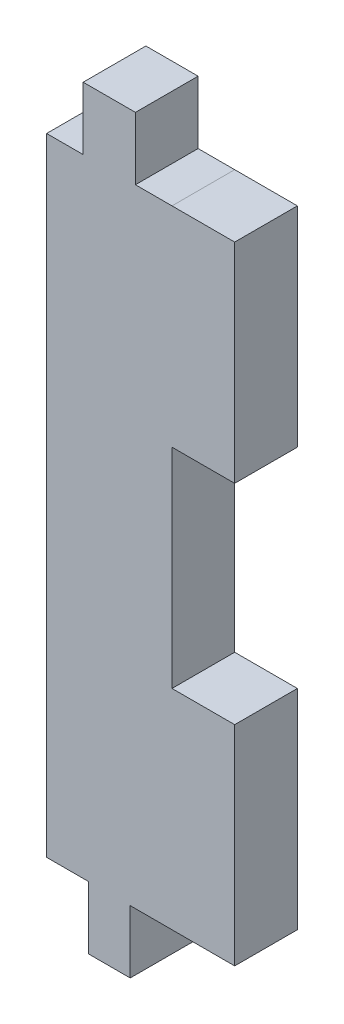
ISO-10303-21;
HEADER;
FILE_DESCRIPTION(('STEP AP214'),'2;1');
FILE_NAME('part.step','',(''),(''),'','','');
FILE_SCHEMA(('AUTOMOTIVE_DESIGN { 1 0 10303 214 1 1 1 1 }'));
ENDSEC;
DATA;
#1=APPLICATION_CONTEXT('core data for automotive mechanical design processes');
#2=APPLICATION_PROTOCOL_DEFINITION('international standard','automotive_design',2000,#1);
#3=PRODUCT_CONTEXT('',#1,'mechanical');
#4=PRODUCT('Part','Part','',(#3));
#5=PRODUCT_RELATED_PRODUCT_CATEGORY('part','',(#4));
#6=PRODUCT_DEFINITION_FORMATION('','',#4);
#7=PRODUCT_DEFINITION_CONTEXT('part definition',#1,'design');
#8=PRODUCT_DEFINITION('design','',#6,#7);
#9=PRODUCT_DEFINITION_SHAPE('','',#8);
#10=(LENGTH_UNIT() NAMED_UNIT(*) SI_UNIT(.MILLI.,.METRE.));
#11=(NAMED_UNIT(*) PLANE_ANGLE_UNIT() SI_UNIT($,.RADIAN.));
#12=(NAMED_UNIT(*) SI_UNIT($,.STERADIAN.) SOLID_ANGLE_UNIT());
#13=UNCERTAINTY_MEASURE_WITH_UNIT(LENGTH_MEASURE(1.E-05),#10,'distance_accuracy_value','');
#14=(GEOMETRIC_REPRESENTATION_CONTEXT(3) GLOBAL_UNCERTAINTY_ASSIGNED_CONTEXT((#13)) GLOBAL_UNIT_ASSIGNED_CONTEXT((#10,
#11,#12)) REPRESENTATION_CONTEXT('',''));
#15=CARTESIAN_POINT('',(0.,0.,0.));
#16=DIRECTION('',(0.,0.,1.));
#17=DIRECTION('',(1.,0.,0.));
#18=AXIS2_PLACEMENT_3D('',#15,#16,#17);
#19=CARTESIAN_POINT('',(-22.2300312184797,-66.1800034107966,5.));
#20=DIRECTION('',(-1.,0.,0.));
#21=DIRECTION('',(0.,0.,1.));
#22=AXIS2_PLACEMENT_3D('',#19,#20,#21);
#23=PLANE('',#22);
#24=DIRECTION('',(0.,0.,-1.));
#25=VECTOR('',#24,1.);
#26=CARTESIAN_POINT('',(-22.2300312184797,-49.5136692647141,5.));
#27=LINE('',#26,#25);
#28=CARTESIAN_POINT('',(-22.2300312184797,-49.5136692647141,5.));
#29=VERTEX_POINT('',#28);
#30=CARTESIAN_POINT('',(-22.2300312184797,-49.5136692647141,0.));
#31=VERTEX_POINT('',#30);
#32=EDGE_CURVE('E111',#29,#31,#27,.T.);
#33=ORIENTED_EDGE('',*,*,#32,.F.);
#34=DIRECTION('',(0.,1.,0.));
#35=VECTOR('',#34,1.);
#36=CARTESIAN_POINT('',(-22.2300312184797,-66.1800034107966,5.));
#37=LINE('',#36,#35);
#38=CARTESIAN_POINT('',(-22.2300312184797,-66.1800034107966,5.));
#39=VERTEX_POINT('',#38);
#40=EDGE_CURVE('E327',#39,#29,#37,.T.);
#41=ORIENTED_EDGE('',*,*,#40,.F.);
#42=DIRECTION('',(0.,0.,-1.));
#43=VECTOR('',#42,1.);
#44=CARTESIAN_POINT('',(-22.2300312184797,-66.1800034107966,5.));
#45=LINE('',#44,#43);
#46=CARTESIAN_POINT('',(-22.2300312184797,-66.1800034107966,0.));
#47=VERTEX_POINT('',#46);
#48=EDGE_CURVE('E238',#39,#47,#45,.T.);
#49=ORIENTED_EDGE('',*,*,#48,.T.);
#50=DIRECTION('',(0.,1.,0.));
#51=VECTOR('',#50,1.);
#52=CARTESIAN_POINT('',(-22.2300312184797,-66.1800034107966,0.));
#53=LINE('',#52,#51);
#54=EDGE_CURVE('E334',#47,#31,#53,.T.);
#55=ORIENTED_EDGE('',*,*,#54,.T.);
#56=EDGE_LOOP('',(#33,#41,#49,#55));
#57=FACE_BOUND('',#56,.T.);
#58=ADVANCED_FACE('F103',(#57),#23,.F.);
#59=CARTESIAN_POINT('',(-37.2300312184796,-66.1800034107966,0.));
#60=DIRECTION('',(0.,0.,1.));
#61=DIRECTION('',(1.,0.,0.));
#62=AXIS2_PLACEMENT_3D('',#59,#60,#61);
#63=PLANE('',#62);
#64=DIRECTION('',(1.,0.,0.));
#65=VECTOR('',#64,1.);
#66=CARTESIAN_POINT('',(-37.2300312184797,-16.1800034107966,0.));
#67=LINE('',#66,#65);
#68=CARTESIAN_POINT('',(-30.1466978851463,-16.1800034107966,0.));
#69=VERTEX_POINT('',#68);
#70=CARTESIAN_POINT('',(-27.2300312184797,-16.1801696710887,0.));
#71=VERTEX_POINT('',#70);
#72=EDGE_CURVE('E255',#69,#71,#67,.T.);
#73=ORIENTED_EDGE('',*,*,#72,.T.);
#74=DIRECTION('',(1.,0.,0.));
#75=VECTOR('',#74,1.);
#76=CARTESIAN_POINT('',(-27.2300312184797,-16.1803359313808,0.));
#77=LINE('',#76,#75);
#78=CARTESIAN_POINT('',(-22.2300312184797,-16.1803359313808,0.));
#79=VERTEX_POINT('',#78);
#80=EDGE_CURVE('E330',#71,#79,#77,.T.);
#81=ORIENTED_EDGE('',*,*,#80,.T.);
#82=CARTESIAN_POINT('',(-22.2300312184797,-32.8470025980475,0.));
#83=VERTEX_POINT('',#82);
#84=EDGE_CURVE('E359',#83,#79,#53,.T.);
#85=ORIENTED_EDGE('',*,*,#84,.F.);
#86=DIRECTION('',(1.,0.,0.));
#87=VECTOR('',#86,1.);
#88=CARTESIAN_POINT('',(-27.2300312184797,-32.8470025980475,0.));
#89=LINE('',#88,#87);
#90=CARTESIAN_POINT('',(-27.2300312184797,-32.8470025980475,0.));
#91=VERTEX_POINT('',#90);
#92=EDGE_CURVE('E357',#91,#83,#89,.T.);
#93=ORIENTED_EDGE('',*,*,#92,.F.);
#94=DIRECTION('',(0.,-1.,0.));
#95=VECTOR('',#94,1.);
#96=CARTESIAN_POINT('',(-27.2300312184797,-66.1800034107966,0.));
#97=LINE('',#96,#95);
#98=CARTESIAN_POINT('',(-27.2300312184797,-49.5136692647141,0.));
#99=VERTEX_POINT('',#98);
#100=EDGE_CURVE('E356',#91,#99,#97,.T.);
#101=ORIENTED_EDGE('',*,*,#100,.T.);
#102=DIRECTION('',(1.,0.,0.));
#103=VECTOR('',#102,1.);
#104=CARTESIAN_POINT('',(-27.2300312184797,-49.5136692647141,0.));
#105=LINE('',#104,#103);
#106=EDGE_CURVE('E344',#99,#31,#105,.T.);
#107=ORIENTED_EDGE('',*,*,#106,.T.);
#108=ORIENTED_EDGE('',*,*,#54,.F.);
#109=DIRECTION('',(1.,0.,0.));
#110=VECTOR('',#109,1.);
#111=CARTESIAN_POINT('',(-37.2300312184796,-66.1800034107966,0.));
#112=LINE('',#111,#110);
#113=CARTESIAN_POINT('',(-30.563364551813,-66.1800034107966,0.));
#114=VERTEX_POINT('',#113);
#115=EDGE_CURVE('E252',#114,#47,#112,.T.);
#116=ORIENTED_EDGE('',*,*,#115,.F.);
#117=DIRECTION('',(0.,-1.,0.));
#118=VECTOR('',#117,1.);
#119=CARTESIAN_POINT('',(-30.563364551813,-61.1800034107967,0.));
#120=LINE('',#119,#118);
#121=CARTESIAN_POINT('',(-30.563364551813,-71.1800034107967,0.));
#122=VERTEX_POINT('',#121);
#123=EDGE_CURVE('E217',#114,#122,#120,.T.);
#124=ORIENTED_EDGE('',*,*,#123,.T.);
#125=DIRECTION('',(1.,0.,0.));
#126=VECTOR('',#125,1.);
#127=CARTESIAN_POINT('',(-33.8966978851463,-71.1800034107967,0.));
#128=LINE('',#127,#126);
#129=CARTESIAN_POINT('',(-33.8966978851463,-71.1800034107967,0.));
#130=VERTEX_POINT('',#129);
#131=EDGE_CURVE('E365',#130,#122,#128,.T.);
#132=ORIENTED_EDGE('',*,*,#131,.F.);
#133=DIRECTION('',(0.,-1.,0.));
#134=VECTOR('',#133,1.);
#135=CARTESIAN_POINT('',(-33.8966978851463,-61.1800034107967,0.));
#136=LINE('',#135,#134);
#137=CARTESIAN_POINT('',(-33.8966978851463,-66.1800034107966,0.));
#138=VERTEX_POINT('',#137);
#139=EDGE_CURVE('E233',#138,#130,#136,.T.);
#140=ORIENTED_EDGE('',*,*,#139,.F.);
#141=CARTESIAN_POINT('',(-37.2300312184796,-66.1800034107966,0.));
#142=VERTEX_POINT('',#141);
#143=EDGE_CURVE('E190',#142,#138,#112,.T.);
#144=ORIENTED_EDGE('',*,*,#143,.F.);
#145=DIRECTION('',(0.,-1.,0.));
#146=VECTOR('',#145,1.);
#147=CARTESIAN_POINT('',(-37.2300312184797,-16.1800034107966,0.));
#148=LINE('',#147,#146);
#149=CARTESIAN_POINT('',(-37.2300312184797,-16.1800034107966,0.));
#150=VERTEX_POINT('',#149);
#151=EDGE_CURVE('E249',#150,#142,#148,.T.);
#152=ORIENTED_EDGE('',*,*,#151,.F.);
#153=CARTESIAN_POINT('',(-34.313364551813,-16.1800034107966,0.));
#154=VERTEX_POINT('',#153);
#155=EDGE_CURVE('E245',#150,#154,#67,.T.);
#156=ORIENTED_EDGE('',*,*,#155,.T.);
#157=DIRECTION('',(0.,-1.,0.));
#158=VECTOR('',#157,1.);
#159=CARTESIAN_POINT('',(-34.313364551813,-11.1800034107966,0.));
#160=LINE('',#159,#158);
#161=CARTESIAN_POINT('',(-34.313364551813,-11.1800034107966,0.));
#162=VERTEX_POINT('',#161);
#163=EDGE_CURVE('E386',#162,#154,#160,.T.);
#164=ORIENTED_EDGE('',*,*,#163,.F.);
#165=DIRECTION('',(1.,0.,0.));
#166=VECTOR('',#165,1.);
#167=CARTESIAN_POINT('',(-34.313364551813,-11.1800034107966,0.));
#168=LINE('',#167,#166);
#169=CARTESIAN_POINT('',(-30.1466978851463,-11.1800034107966,0.));
#170=VERTEX_POINT('',#169);
#171=EDGE_CURVE('E377',#162,#170,#168,.T.);
#172=ORIENTED_EDGE('',*,*,#171,.T.);
#173=DIRECTION('',(0.,-1.,0.));
#174=VECTOR('',#173,1.);
#175=CARTESIAN_POINT('',(-30.1466978851463,-11.1800034107966,0.));
#176=LINE('',#175,#174);
#177=EDGE_CURVE('E390',#170,#69,#176,.T.);
#178=ORIENTED_EDGE('',*,*,#177,.T.);
#179=EDGE_LOOP('',(#73,#81,#85,#93,#101,#107,#108,#116,#124,#132,#140,#144,#152,#156,#164,#172,#178));
#180=FACE_BOUND('',#179,.T.);
#181=ADVANCED_FACE('F279',(#180),#63,.F.);
#182=CARTESIAN_POINT('',(-37.2300312184796,-66.1800034107966,5.));
#183=DIRECTION('',(0.,0.,1.));
#184=DIRECTION('',(1.,0.,0.));
#185=AXIS2_PLACEMENT_3D('',#182,#183,#184);
#186=PLANE('',#185);
#187=DIRECTION('',(-1.,0.,0.));
#188=VECTOR('',#187,1.);
#189=CARTESIAN_POINT('',(-37.2300312184796,-32.8470025980475,5.));
#190=LINE('',#189,#188);
#191=CARTESIAN_POINT('',(-22.2300312184797,-32.8470025980475,5.));
#192=VERTEX_POINT('',#191);
#193=CARTESIAN_POINT('',(-27.2300312184797,-32.8470025980475,5.));
#194=VERTEX_POINT('',#193);
#195=EDGE_CURVE('E572',#192,#194,#190,.T.);
#196=ORIENTED_EDGE('',*,*,#195,.F.);
#197=CARTESIAN_POINT('',(-22.2300312184797,-16.1803359313808,5.));
#198=VERTEX_POINT('',#197);
#199=EDGE_CURVE('E333',#192,#198,#37,.T.);
#200=ORIENTED_EDGE('',*,*,#199,.T.);
#201=DIRECTION('',(1.,0.,0.));
#202=VECTOR('',#201,1.);
#203=CARTESIAN_POINT('',(-27.2300312184797,-16.1803359313808,5.));
#204=LINE('',#203,#202);
#205=CARTESIAN_POINT('',(-27.2300312184797,-16.1801696710887,5.));
#206=VERTEX_POINT('',#205);
#207=EDGE_CURVE('E318',#206,#198,#204,.T.);
#208=ORIENTED_EDGE('',*,*,#207,.F.);
#209=DIRECTION('',(1.,0.,0.));
#210=VECTOR('',#209,1.);
#211=CARTESIAN_POINT('',(-37.2300312184797,-16.1800034107966,5.));
#212=LINE('',#211,#210);
#213=CARTESIAN_POINT('',(-30.1466978851463,-16.1800034107966,5.));
#214=VERTEX_POINT('',#213);
#215=EDGE_CURVE('E243',#214,#206,#212,.T.);
#216=ORIENTED_EDGE('',*,*,#215,.F.);
#217=DIRECTION('',(0.,-1.,0.));
#218=VECTOR('',#217,1.);
#219=CARTESIAN_POINT('',(-30.1466978851463,-11.1800034107966,5.));
#220=LINE('',#219,#218);
#221=CARTESIAN_POINT('',(-30.1466978851463,-11.1800034107966,5.));
#222=VERTEX_POINT('',#221);
#223=EDGE_CURVE('E397',#222,#214,#220,.T.);
#224=ORIENTED_EDGE('',*,*,#223,.F.);
#225=DIRECTION('',(1.,0.,0.));
#226=VECTOR('',#225,1.);
#227=CARTESIAN_POINT('',(-34.313364551813,-11.1800034107966,5.));
#228=LINE('',#227,#226);
#229=CARTESIAN_POINT('',(-34.313364551813,-11.1800034107966,5.));
#230=VERTEX_POINT('',#229);
#231=EDGE_CURVE('E389',#230,#222,#228,.T.);
#232=ORIENTED_EDGE('',*,*,#231,.F.);
#233=DIRECTION('',(0.,-1.,0.));
#234=VECTOR('',#233,1.);
#235=CARTESIAN_POINT('',(-34.313364551813,-11.1800034107966,5.));
#236=LINE('',#235,#234);
#237=CARTESIAN_POINT('',(-34.313364551813,-16.1800034107966,5.));
#238=VERTEX_POINT('',#237);
#239=EDGE_CURVE('E384',#230,#238,#236,.T.);
#240=ORIENTED_EDGE('',*,*,#239,.T.);
#241=CARTESIAN_POINT('',(-37.2300312184797,-16.1800034107966,5.));
#242=VERTEX_POINT('',#241);
#243=EDGE_CURVE('E258',#242,#238,#212,.T.);
#244=ORIENTED_EDGE('',*,*,#243,.F.);
#245=DIRECTION('',(0.,-1.,0.));
#246=VECTOR('',#245,1.);
#247=CARTESIAN_POINT('',(-37.2300312184797,-16.1800034107966,5.));
#248=LINE('',#247,#246);
#249=CARTESIAN_POINT('',(-37.2300312184796,-66.1800034107966,5.));
#250=VERTEX_POINT('',#249);
#251=EDGE_CURVE('E240',#242,#250,#248,.T.);
#252=ORIENTED_EDGE('',*,*,#251,.T.);
#253=DIRECTION('',(1.,0.,0.));
#254=VECTOR('',#253,1.);
#255=CARTESIAN_POINT('',(-37.2300312184796,-66.1800034107966,5.));
#256=LINE('',#255,#254);
#257=CARTESIAN_POINT('',(-33.8966978851463,-66.1800034107966,5.));
#258=VERTEX_POINT('',#257);
#259=EDGE_CURVE('E239',#250,#258,#256,.T.);
#260=ORIENTED_EDGE('',*,*,#259,.T.);
#261=DIRECTION('',(0.,-1.,0.));
#262=VECTOR('',#261,1.);
#263=CARTESIAN_POINT('',(-33.8966978851463,-61.1800034107967,5.));
#264=LINE('',#263,#262);
#265=CARTESIAN_POINT('',(-33.8966978851463,-71.1800034107967,5.));
#266=VERTEX_POINT('',#265);
#267=EDGE_CURVE('E371',#258,#266,#264,.T.);
#268=ORIENTED_EDGE('',*,*,#267,.T.);
#269=DIRECTION('',(1.,0.,0.));
#270=VECTOR('',#269,1.);
#271=CARTESIAN_POINT('',(-33.8966978851463,-71.1800034107967,5.));
#272=LINE('',#271,#270);
#273=CARTESIAN_POINT('',(-30.563364551813,-71.1800034107967,5.));
#274=VERTEX_POINT('',#273);
#275=EDGE_CURVE('E231',#266,#274,#272,.T.);
#276=ORIENTED_EDGE('',*,*,#275,.T.);
#277=DIRECTION('',(0.,-1.,0.));
#278=VECTOR('',#277,1.);
#279=CARTESIAN_POINT('',(-30.563364551813,-61.1800034107967,5.));
#280=LINE('',#279,#278);
#281=CARTESIAN_POINT('',(-30.563364551813,-66.1800034107966,5.));
#282=VERTEX_POINT('',#281);
#283=EDGE_CURVE('E215',#282,#274,#280,.T.);
#284=ORIENTED_EDGE('',*,*,#283,.F.);
#285=EDGE_CURVE('E228',#282,#39,#256,.T.);
#286=ORIENTED_EDGE('',*,*,#285,.T.);
#287=ORIENTED_EDGE('',*,*,#40,.T.);
#288=DIRECTION('',(-1.,0.,0.));
#289=VECTOR('',#288,1.);
#290=CARTESIAN_POINT('',(-37.2300312184796,-49.5136692647141,5.));
#291=LINE('',#290,#289);
#292=CARTESIAN_POINT('',(-27.2300312184797,-49.5136692647141,5.));
#293=VERTEX_POINT('',#292);
#294=EDGE_CURVE('E118',#29,#293,#291,.T.);
#295=ORIENTED_EDGE('',*,*,#294,.T.);
#296=DIRECTION('',(0.,-1.,0.));
#297=VECTOR('',#296,1.);
#298=CARTESIAN_POINT('',(-27.2300312184797,-66.1800034107966,5.));
#299=LINE('',#298,#297);
#300=EDGE_CURVE('E576',#194,#293,#299,.T.);
#301=ORIENTED_EDGE('',*,*,#300,.F.);
#302=EDGE_LOOP('',(#196,#200,#208,#216,#224,#232,#240,#244,#252,#260,#268,#276,#284,#286,#287,
#295,#301));
#303=FACE_BOUND('',#302,.T.);
#304=ADVANCED_FACE('F226',(#303),#186,.T.);
#305=CARTESIAN_POINT('',(-37.2300312184797,-16.1800034107966,5.));
#306=DIRECTION('',(0.,1.,0.));
#307=DIRECTION('',(0.,0.,1.));
#308=AXIS2_PLACEMENT_3D('',#305,#306,#307);
#309=PLANE('',#308);
#310=ORIENTED_EDGE('',*,*,#243,.T.);
#311=DIRECTION('',(0.,0.,-1.));
#312=VECTOR('',#311,1.);
#313=CARTESIAN_POINT('',(-34.313364551813,-16.1800034107966,5.));
#314=LINE('',#313,#312);
#315=EDGE_CURVE('E222',#238,#154,#314,.T.);
#316=ORIENTED_EDGE('',*,*,#315,.T.);
#317=ORIENTED_EDGE('',*,*,#155,.F.);
#318=DIRECTION('',(0.,0.,-1.));
#319=VECTOR('',#318,1.);
#320=CARTESIAN_POINT('',(-37.2300312184797,-16.1800034107966,5.));
#321=LINE('',#320,#319);
#322=EDGE_CURVE('E256',#242,#150,#321,.T.);
#323=ORIENTED_EDGE('',*,*,#322,.F.);
#324=EDGE_LOOP('',(#310,#316,#317,#323));
#325=FACE_BOUND('',#324,.T.);
#326=ADVANCED_FACE('F277',(#325),#309,.T.);
#327=CARTESIAN_POINT('',(-37.2300312184797,-16.1800034107966,5.));
#328=DIRECTION('',(1.,0.,0.));
#329=DIRECTION('',(0.,1.,0.));
#330=AXIS2_PLACEMENT_3D('',#327,#328,#329);
#331=PLANE('',#330);
#332=ORIENTED_EDGE('',*,*,#151,.T.);
#333=DIRECTION('',(0.,0.,-1.));
#334=VECTOR('',#333,1.);
#335=CARTESIAN_POINT('',(-37.2300312184796,-66.1800034107966,5.));
#336=LINE('',#335,#334);
#337=EDGE_CURVE('E259',#250,#142,#336,.T.);
#338=ORIENTED_EDGE('',*,*,#337,.F.);
#339=ORIENTED_EDGE('',*,*,#251,.F.);
#340=ORIENTED_EDGE('',*,*,#322,.T.);
#341=EDGE_LOOP('',(#332,#338,#339,#340));
#342=FACE_BOUND('',#341,.T.);
#343=ADVANCED_FACE('F284',(#342),#331,.F.);
#344=CARTESIAN_POINT('',(-37.2300312184796,-66.1800034107966,5.));
#345=DIRECTION('',(0.,1.,0.));
#346=DIRECTION('',(0.,0.,1.));
#347=AXIS2_PLACEMENT_3D('',#344,#345,#346);
#348=PLANE('',#347);
#349=DIRECTION('',(0.,0.,-1.));
#350=VECTOR('',#349,1.);
#351=CARTESIAN_POINT('',(-33.8966978851463,-66.1800034107966,5.));
#352=LINE('',#351,#350);
#353=EDGE_CURVE('E221',#258,#138,#352,.T.);
#354=ORIENTED_EDGE('',*,*,#353,.F.);
#355=ORIENTED_EDGE('',*,*,#259,.F.);
#356=ORIENTED_EDGE('',*,*,#337,.T.);
#357=ORIENTED_EDGE('',*,*,#143,.T.);
#358=EDGE_LOOP('',(#354,#355,#356,#357));
#359=FACE_BOUND('',#358,.T.);
#360=ADVANCED_FACE('F283',(#359),#348,.F.);
#361=ORIENTED_EDGE('',*,*,#285,.F.);
#362=DIRECTION('',(0.,0.,-1.));
#363=VECTOR('',#362,1.);
#364=CARTESIAN_POINT('',(-30.563364551813,-66.1800034107966,5.));
#365=LINE('',#364,#363);
#366=EDGE_CURVE('E211',#282,#114,#365,.T.);
#367=ORIENTED_EDGE('',*,*,#366,.T.);
#368=ORIENTED_EDGE('',*,*,#115,.T.);
#369=ORIENTED_EDGE('',*,*,#48,.F.);
#370=EDGE_LOOP('',(#361,#367,#368,#369));
#371=FACE_BOUND('',#370,.T.);
#372=ADVANCED_FACE('F236',(#371),#348,.F.);
#373=DIRECTION('',(0.,0.,-1.));
#374=VECTOR('',#373,1.);
#375=CARTESIAN_POINT('',(-30.1466978851463,-16.1800034107966,5.));
#376=LINE('',#375,#374);
#377=EDGE_CURVE('E127',#214,#69,#376,.T.);
#378=ORIENTED_EDGE('',*,*,#377,.F.);
#379=ORIENTED_EDGE('',*,*,#215,.T.);
#380=CARTESIAN_POINT('',(-27.2300312184797,-16.1800034107966,5.));
#381=DIRECTION('',(0.,0.,-1.));
#382=VECTOR('',#381,1.);
#383=LINE('',#380,#382);
#384=EDGE_CURVE('E179',#206,#71,#383,.T.);
#385=ORIENTED_EDGE('',*,*,#384,.T.);
#386=ORIENTED_EDGE('',*,*,#72,.F.);
#387=EDGE_LOOP('',(#378,#379,#385,#386));
#388=FACE_BOUND('',#387,.T.);
#389=ADVANCED_FACE('F266',(#388),#309,.T.);
#390=CARTESIAN_POINT('',(-33.8966978851463,-71.1800034107967,5.));
#391=DIRECTION('',(0.,1.,0.));
#392=DIRECTION('',(0.,0.,1.));
#393=AXIS2_PLACEMENT_3D('',#390,#391,#392);
#394=PLANE('',#393);
#395=ORIENTED_EDGE('',*,*,#131,.T.);
#396=DIRECTION('',(0.,0.,-1.));
#397=VECTOR('',#396,1.);
#398=CARTESIAN_POINT('',(-30.563364551813,-71.1800034107967,5.));
#399=LINE('',#398,#397);
#400=EDGE_CURVE('E378',#274,#122,#399,.T.);
#401=ORIENTED_EDGE('',*,*,#400,.F.);
#402=ORIENTED_EDGE('',*,*,#275,.F.);
#403=DIRECTION('',(0.,0.,-1.));
#404=VECTOR('',#403,1.);
#405=CARTESIAN_POINT('',(-33.8966978851463,-71.1800034107967,5.));
#406=LINE('',#405,#404);
#407=EDGE_CURVE('E375',#266,#130,#406,.T.);
#408=ORIENTED_EDGE('',*,*,#407,.T.);
#409=EDGE_LOOP('',(#395,#401,#402,#408));
#410=FACE_BOUND('',#409,.T.);
#411=ADVANCED_FACE('F276',(#410),#394,.F.);
#412=CARTESIAN_POINT('',(-30.563364551813,-61.1800034107967,5.));
#413=DIRECTION('',(1.,0.,0.));
#414=DIRECTION('',(0.,0.,-1.));
#415=AXIS2_PLACEMENT_3D('',#412,#413,#414);
#416=PLANE('',#415);
#417=ORIENTED_EDGE('',*,*,#366,.F.);
#418=ORIENTED_EDGE('',*,*,#283,.T.);
#419=ORIENTED_EDGE('',*,*,#400,.T.);
#420=ORIENTED_EDGE('',*,*,#123,.F.);
#421=EDGE_LOOP('',(#417,#418,#419,#420));
#422=FACE_BOUND('',#421,.T.);
#423=ADVANCED_FACE('F213',(#422),#416,.T.);
#424=CARTESIAN_POINT('',(-33.8966978851463,-61.1800034107967,5.));
#425=DIRECTION('',(1.,0.,0.));
#426=DIRECTION('',(0.,0.,-1.));
#427=AXIS2_PLACEMENT_3D('',#424,#425,#426);
#428=PLANE('',#427);
#429=ORIENTED_EDGE('',*,*,#267,.F.);
#430=ORIENTED_EDGE('',*,*,#353,.T.);
#431=ORIENTED_EDGE('',*,*,#139,.T.);
#432=ORIENTED_EDGE('',*,*,#407,.F.);
#433=EDGE_LOOP('',(#429,#430,#431,#432));
#434=FACE_BOUND('',#433,.T.);
#435=ADVANCED_FACE('F278',(#434),#428,.F.);
#436=CARTESIAN_POINT('',(-27.2300312184797,-16.1803359313808,5.));
#437=DIRECTION('',(0.,1.,0.));
#438=DIRECTION('',(0.,0.,1.));
#439=AXIS2_PLACEMENT_3D('',#436,#437,#438);
#440=PLANE('',#439);
#441=ORIENTED_EDGE('',*,*,#80,.F.);
#442=ORIENTED_EDGE('',*,*,#384,.F.);
#443=ORIENTED_EDGE('',*,*,#207,.T.);
#444=DIRECTION('',(0.,0.,-1.));
#445=VECTOR('',#444,1.);
#446=CARTESIAN_POINT('',(-22.2300312184797,-16.1803359313808,5.));
#447=LINE('',#446,#445);
#448=EDGE_CURVE('E326',#198,#79,#447,.T.);
#449=ORIENTED_EDGE('',*,*,#448,.T.);
#450=EDGE_LOOP('',(#441,#442,#443,#449));
#451=FACE_BOUND('',#450,.T.);
#452=ADVANCED_FACE('F303',(#451),#440,.T.);
#453=ORIENTED_EDGE('',*,*,#199,.F.);
#454=DIRECTION('',(0.,0.,-1.));
#455=VECTOR('',#454,1.);
#456=CARTESIAN_POINT('',(-22.2300312184797,-32.8470025980475,5.));
#457=LINE('',#456,#455);
#458=EDGE_CURVE('E12',#192,#83,#457,.T.);
#459=ORIENTED_EDGE('',*,*,#458,.T.);
#460=ORIENTED_EDGE('',*,*,#84,.T.);
#461=ORIENTED_EDGE('',*,*,#448,.F.);
#462=EDGE_LOOP('',(#453,#459,#460,#461));
#463=FACE_BOUND('',#462,.T.);
#464=ADVANCED_FACE('F105',(#463),#23,.F.);
#465=CARTESIAN_POINT('',(-30.1466978851463,-11.1800034107966,5.));
#466=DIRECTION('',(1.,0.,0.));
#467=DIRECTION('',(0.,0.,-1.));
#468=AXIS2_PLACEMENT_3D('',#465,#466,#467);
#469=PLANE('',#468);
#470=ORIENTED_EDGE('',*,*,#223,.T.);
#471=ORIENTED_EDGE('',*,*,#377,.T.);
#472=ORIENTED_EDGE('',*,*,#177,.F.);
#473=DIRECTION('',(0.,0.,-1.));
#474=VECTOR('',#473,1.);
#475=CARTESIAN_POINT('',(-30.1466978851463,-11.1800034107966,5.));
#476=LINE('',#475,#474);
#477=EDGE_CURVE('E382',#222,#170,#476,.T.);
#478=ORIENTED_EDGE('',*,*,#477,.F.);
#479=EDGE_LOOP('',(#470,#471,#472,#478));
#480=FACE_BOUND('',#479,.T.);
#481=ADVANCED_FACE('F294',(#480),#469,.T.);
#482=CARTESIAN_POINT('',(-34.313364551813,-11.1800034107966,5.));
#483=DIRECTION('',(0.,1.,0.));
#484=DIRECTION('',(0.,0.,1.));
#485=AXIS2_PLACEMENT_3D('',#482,#483,#484);
#486=PLANE('',#485);
#487=ORIENTED_EDGE('',*,*,#171,.F.);
#488=DIRECTION('',(0.,0.,-1.));
#489=VECTOR('',#488,1.);
#490=CARTESIAN_POINT('',(-34.313364551813,-11.1800034107966,5.));
#491=LINE('',#490,#489);
#492=EDGE_CURVE('E253',#230,#162,#491,.T.);
#493=ORIENTED_EDGE('',*,*,#492,.F.);
#494=ORIENTED_EDGE('',*,*,#231,.T.);
#495=ORIENTED_EDGE('',*,*,#477,.T.);
#496=EDGE_LOOP('',(#487,#493,#494,#495));
#497=FACE_BOUND('',#496,.T.);
#498=ADVANCED_FACE('F292',(#497),#486,.T.);
#499=CARTESIAN_POINT('',(-34.313364551813,-11.1800034107966,5.));
#500=DIRECTION('',(1.,0.,0.));
#501=DIRECTION('',(0.,0.,-1.));
#502=AXIS2_PLACEMENT_3D('',#499,#500,#501);
#503=PLANE('',#502);
#504=ORIENTED_EDGE('',*,*,#315,.F.);
#505=ORIENTED_EDGE('',*,*,#239,.F.);
#506=ORIENTED_EDGE('',*,*,#492,.T.);
#507=ORIENTED_EDGE('',*,*,#163,.T.);
#508=EDGE_LOOP('',(#504,#505,#506,#507));
#509=FACE_BOUND('',#508,.T.);
#510=ADVANCED_FACE('F288',(#509),#503,.F.);
#511=CARTESIAN_POINT('',(-27.2300312184797,-66.1803359313808,-10.));
#512=DIRECTION('',(-1.,0.,0.));
#513=DIRECTION('',(0.,0.,1.));
#514=AXIS2_PLACEMENT_3D('',#511,#512,#513);
#515=PLANE('',#514);
#516=DIRECTION('',(0.,0.,1.));
#517=VECTOR('',#516,1.);
#518=CARTESIAN_POINT('',(-27.2300312184797,-32.8470025980475,0.));
#519=LINE('',#518,#517);
#520=EDGE_CURVE('E574',#91,#194,#519,.T.);
#521=ORIENTED_EDGE('',*,*,#520,.T.);
#522=ORIENTED_EDGE('',*,*,#300,.T.);
#523=DIRECTION('',(0.,0.,1.));
#524=VECTOR('',#523,1.);
#525=CARTESIAN_POINT('',(-27.2300312184797,-49.5136692647141,0.));
#526=LINE('',#525,#524);
#527=EDGE_CURVE('E579',#99,#293,#526,.T.);
#528=ORIENTED_EDGE('',*,*,#527,.F.);
#529=ORIENTED_EDGE('',*,*,#100,.F.);
#530=EDGE_LOOP('',(#521,#522,#528,#529));
#531=FACE_BOUND('',#530,.T.);
#532=ADVANCED_FACE('F291',(#531),#515,.F.);
#533=CARTESIAN_POINT('',(-27.2300312184797,-32.8470025980475,0.));
#534=DIRECTION('',(0.,1.,0.));
#535=DIRECTION('',(-1.,0.,0.));
#536=AXIS2_PLACEMENT_3D('',#533,#534,#535);
#537=PLANE('',#536);
#538=ORIENTED_EDGE('',*,*,#195,.T.);
#539=ORIENTED_EDGE('',*,*,#520,.F.);
#540=ORIENTED_EDGE('',*,*,#92,.T.);
#541=ORIENTED_EDGE('',*,*,#458,.F.);
#542=EDGE_LOOP('',(#538,#539,#540,#541));
#543=FACE_BOUND('',#542,.T.);
#544=ADVANCED_FACE('F553',(#543),#537,.F.);
#545=CARTESIAN_POINT('',(-27.2300312184797,-49.5136692647141,0.));
#546=DIRECTION('',(0.,1.,0.));
#547=DIRECTION('',(-1.,0.,0.));
#548=AXIS2_PLACEMENT_3D('',#545,#546,#547);
#549=PLANE('',#548);
#550=ORIENTED_EDGE('',*,*,#32,.T.);
#551=ORIENTED_EDGE('',*,*,#106,.F.);
#552=ORIENTED_EDGE('',*,*,#527,.T.);
#553=ORIENTED_EDGE('',*,*,#294,.F.);
#554=EDGE_LOOP('',(#550,#551,#552,#553));
#555=FACE_BOUND('',#554,.T.);
#556=ADVANCED_FACE('F342',(#555),#549,.T.);
#557=CLOSED_SHELL('',(#58,#181,#304,#326,#343,#360,#372,#389,#411,#423,#435,#452,#464,#481,#498,
#510,#532,#544,#556));
#558=MANIFOLD_SOLID_BREP('B2',#557);
#559=ADVANCED_BREP_SHAPE_REPRESENTATION('',(#18,#558),#14);
#560=SHAPE_DEFINITION_REPRESENTATION(#9,#559);
ENDSEC;
END-ISO-10303-21;
